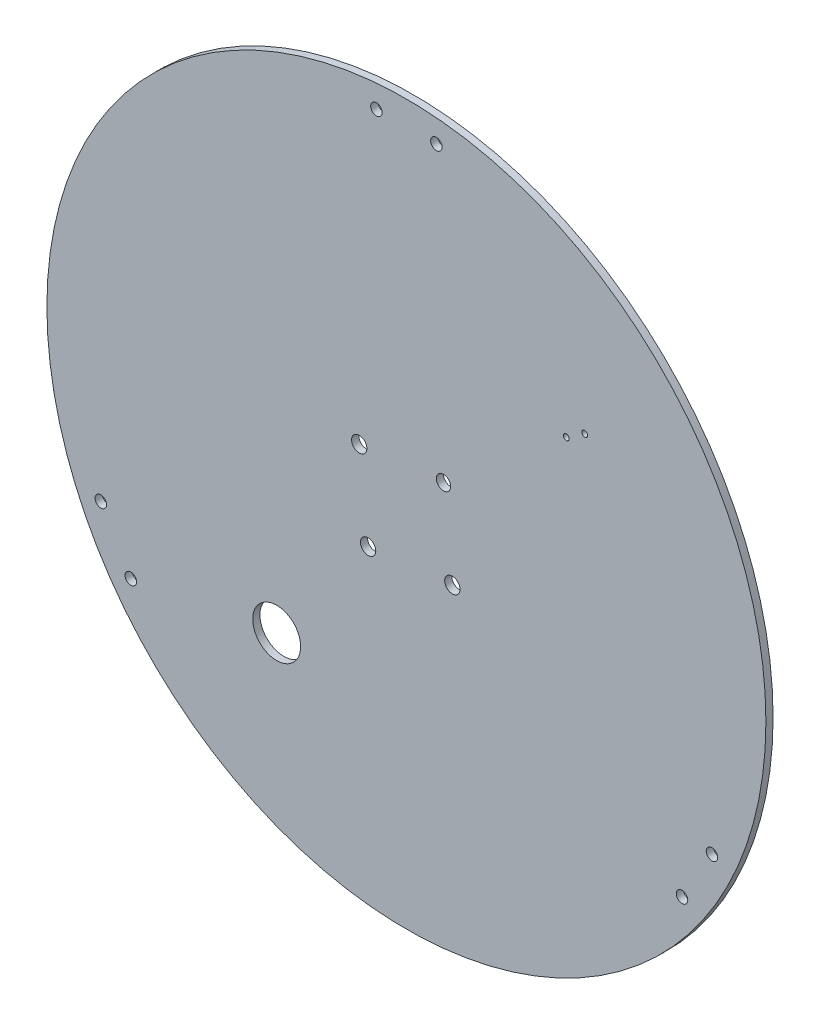
ISO-10303-21;
HEADER;
FILE_DESCRIPTION(('STEP AP214'),'2;1');
FILE_NAME('part.step','',(''),(''),'','','');
FILE_SCHEMA(('AUTOMOTIVE_DESIGN { 1 0 10303 214 1 1 1 1 }'));
ENDSEC;
DATA;
#1=APPLICATION_CONTEXT('core data for automotive mechanical design processes');
#2=APPLICATION_PROTOCOL_DEFINITION('international standard','automotive_design',2000,#1);
#3=PRODUCT_CONTEXT('',#1,'mechanical');
#4=PRODUCT('Part','Part','',(#3));
#5=PRODUCT_RELATED_PRODUCT_CATEGORY('part','',(#4));
#6=PRODUCT_DEFINITION_FORMATION('','',#4);
#7=PRODUCT_DEFINITION_CONTEXT('part definition',#1,'design');
#8=PRODUCT_DEFINITION('design','',#6,#7);
#9=PRODUCT_DEFINITION_SHAPE('','',#8);
#10=(LENGTH_UNIT() NAMED_UNIT(*) SI_UNIT(.MILLI.,.METRE.));
#11=(NAMED_UNIT(*) PLANE_ANGLE_UNIT() SI_UNIT($,.RADIAN.));
#12=(NAMED_UNIT(*) SI_UNIT($,.STERADIAN.) SOLID_ANGLE_UNIT());
#13=UNCERTAINTY_MEASURE_WITH_UNIT(LENGTH_MEASURE(1.E-05),#10,'distance_accuracy_value','');
#14=(GEOMETRIC_REPRESENTATION_CONTEXT(3) GLOBAL_UNCERTAINTY_ASSIGNED_CONTEXT((#13)) GLOBAL_UNIT_ASSIGNED_CONTEXT((#10,
#11,#12)) REPRESENTATION_CONTEXT('',''));
#15=CARTESIAN_POINT('',(0.,0.,0.));
#16=DIRECTION('',(0.,0.,1.));
#17=DIRECTION('',(1.,0.,0.));
#18=AXIS2_PLACEMENT_3D('',#15,#16,#17);
#19=CARTESIAN_POINT('',(1.00516695487656,1.28351001611725,3.));
#20=DIRECTION('',(0.,0.,1.));
#21=DIRECTION('',(1.,0.,0.));
#22=AXIS2_PLACEMENT_3D('',#19,#20,#21);
#23=PLANE('',#22);
#24=CARTESIAN_POINT('',(16.4868849924029,20.3912815485137,3.));
#25=DIRECTION('',(0.,0.,1.));
#26=DIRECTION('',(1.,0.,0.));
#27=AXIS2_PLACEMENT_3D('',#24,#25,#26);
#28=CIRCLE('',#27,2.98529571712637);
#29=CARTESIAN_POINT('',(19.4721807095292,20.3912815485137,3.));
#30=VERTEX_POINT('',#29);
#31=EDGE_CURVE('E115',#30,#30,#28,.T.);
#32=ORIENTED_EDGE('',*,*,#31,.F.);
#33=EDGE_LOOP('',(#32));
#34=FACE_BOUND('',#33,.T.);
#35=CARTESIAN_POINT('',(20.1825242525812,-14.7703772641566,3.));
#36=DIRECTION('',(0.,0.,1.));
#37=DIRECTION('',(1.,0.,0.));
#38=AXIS2_PLACEMENT_3D('',#35,#36,#37);
#39=CIRCLE('',#38,3.19999999999986);
#40=CARTESIAN_POINT('',(23.382524252581,-14.7703772641566,3.));
#41=VERTEX_POINT('',#40);
#42=EDGE_CURVE('E103',#41,#41,#39,.T.);
#43=ORIENTED_EDGE('',*,*,#42,.F.);
#44=EDGE_LOOP('',(#43));
#45=FACE_BOUND('',#44,.T.);
#46=CARTESIAN_POINT('',(67.7119996408379,62.3988380870922,3.));
#47=DIRECTION('',(0.,0.,1.));
#48=DIRECTION('',(1.,0.,0.));
#49=AXIS2_PLACEMENT_3D('',#46,#47,#48);
#50=CIRCLE('',#49,1.2);
#51=CARTESIAN_POINT('',(68.9119996408379,62.3988380870922,3.));
#52=VERTEX_POINT('',#51);
#53=EDGE_CURVE('E91',#52,#52,#50,.T.);
#54=ORIENTED_EDGE('',*,*,#53,.F.);
#55=EDGE_LOOP('',(#54));
#56=FACE_BOUND('',#55,.T.);
#57=CARTESIAN_POINT('',(-113.988389574945,-79.5418075311884,3.));
#58=DIRECTION('',(0.,0.,1.));
#59=DIRECTION('',(1.,0.,0.));
#60=AXIS2_PLACEMENT_3D('',#57,#58,#59);
#61=CIRCLE('',#60,2.4);
#62=CARTESIAN_POINT('',(-111.588389574945,-79.5418075311884,3.));
#63=VERTEX_POINT('',#62);
#64=EDGE_CURVE('E79',#63,#63,#61,.T.);
#65=ORIENTED_EDGE('',*,*,#64,.F.);
#66=EDGE_LOOP('',(#65));
#67=FACE_BOUND('',#66,.T.);
#68=CARTESIAN_POINT('',(128.498723484698,-57.8911724365774,3.));
#69=DIRECTION('',(0.,0.,1.));
#70=DIRECTION('',(1.,0.,0.));
#71=AXIS2_PLACEMENT_3D('',#68,#69,#70);
#72=CIRCLE('',#71,2.4);
#73=CARTESIAN_POINT('',(130.898723484698,-57.8911724365774,3.));
#74=VERTEX_POINT('',#73);
#75=EDGE_CURVE('E67',#74,#74,#72,.T.);
#76=ORIENTED_EDGE('',*,*,#75,.F.);
#77=EDGE_LOOP('',(#76));
#78=FACE_BOUND('',#77,.T.);
#79=CARTESIAN_POINT('',(-11.4948330451235,141.283510016117,3.));
#80=DIRECTION('',(0.,0.,1.));
#81=DIRECTION('',(1.,0.,0.));
#82=AXIS2_PLACEMENT_3D('',#79,#80,#81);
#83=CIRCLE('',#82,2.40000000000002);
#84=CARTESIAN_POINT('',(-9.09483304512353,141.283510016117,3.));
#85=VERTEX_POINT('',#84);
#86=EDGE_CURVE('E55',#85,#85,#83,.T.);
#87=ORIENTED_EDGE('',*,*,#86,.F.);
#88=EDGE_LOOP('',(#87));
#89=FACE_BOUND('',#88,.T.);
#90=CARTESIAN_POINT('',(1.00516695487656,1.28351001611725,3.));
#91=DIRECTION('',(0.,0.,1.));
#92=DIRECTION('',(1.,0.,0.));
#93=AXIS2_PLACEMENT_3D('',#90,#91,#92);
#94=CIRCLE('',#93,150.);
#95=CARTESIAN_POINT('',(151.005166954877,1.28351001611725,3.));
#96=VERTEX_POINT('',#95);
#97=EDGE_CURVE('E10',#96,#96,#94,.T.);
#98=ORIENTED_EDGE('',*,*,#97,.T.);
#99=EDGE_LOOP('',(#98));
#100=FACE_BOUND('',#99,.T.);
#101=CARTESIAN_POINT('',(13.5051669548765,141.283510016117,3.));
#102=DIRECTION('',(0.,0.,1.));
#103=DIRECTION('',(1.,0.,0.));
#104=AXIS2_PLACEMENT_3D('',#101,#102,#103);
#105=CIRCLE('',#104,2.40000000000001);
#106=CARTESIAN_POINT('',(15.9051669548765,141.283510016117,3.));
#107=VERTEX_POINT('',#106);
#108=EDGE_CURVE('E50',#107,#107,#105,.T.);
#109=ORIENTED_EDGE('',*,*,#108,.F.);
#110=EDGE_LOOP('',(#109));
#111=FACE_BOUND('',#110,.T.);
#112=CARTESIAN_POINT('',(115.998723484698,-79.5418075311884,3.));
#113=DIRECTION('',(0.,0.,1.));
#114=DIRECTION('',(1.,0.,0.));
#115=AXIS2_PLACEMENT_3D('',#112,#113,#114);
#116=CIRCLE('',#115,2.4);
#117=CARTESIAN_POINT('',(118.398723484698,-79.5418075311884,3.));
#118=VERTEX_POINT('',#117);
#119=EDGE_CURVE('E61',#118,#118,#116,.T.);
#120=ORIENTED_EDGE('',*,*,#119,.F.);
#121=EDGE_LOOP('',(#120));
#122=FACE_BOUND('',#121,.T.);
#123=CARTESIAN_POINT('',(-126.488389574945,-57.8911724365775,3.));
#124=DIRECTION('',(0.,0.,1.));
#125=DIRECTION('',(1.,0.,0.));
#126=AXIS2_PLACEMENT_3D('',#123,#124,#125);
#127=CIRCLE('',#126,2.4);
#128=CARTESIAN_POINT('',(-124.088389574945,-57.8911724365775,3.));
#129=VERTEX_POINT('',#128);
#130=EDGE_CURVE('E73',#129,#129,#127,.T.);
#131=ORIENTED_EDGE('',*,*,#130,.F.);
#132=EDGE_LOOP('',(#131));
#133=FACE_BOUND('',#132,.T.);
#134=CARTESIAN_POINT('',(75.4119996408379,67.4988380870922,3.));
#135=DIRECTION('',(0.,0.,1.));
#136=DIRECTION('',(1.,0.,0.));
#137=AXIS2_PLACEMENT_3D('',#134,#135,#136);
#138=CIRCLE('',#137,1.2);
#139=CARTESIAN_POINT('',(76.6119996408379,67.4988380870922,3.));
#140=VERTEX_POINT('',#139);
#141=EDGE_CURVE('E85',#140,#140,#138,.T.);
#142=ORIENTED_EDGE('',*,*,#141,.F.);
#143=EDGE_LOOP('',(#142));
#144=FACE_BOUND('',#143,.T.);
#145=CARTESIAN_POINT('',(-53.1206434953184,-68.716489983883,3.));
#146=DIRECTION('',(0.,0.,1.));
#147=DIRECTION('',(1.,0.,0.));
#148=AXIS2_PLACEMENT_3D('',#145,#146,#147);
#149=CIRCLE('',#148,10.);
#150=CARTESIAN_POINT('',(-43.1206434953184,-68.716489983883,3.));
#151=VERTEX_POINT('',#150);
#152=EDGE_CURVE('E97',#151,#151,#149,.T.);
#153=ORIENTED_EDGE('',*,*,#152,.F.);
#154=EDGE_LOOP('',(#153));
#155=FACE_BOUND('',#154,.T.);
#156=CARTESIAN_POINT('',(-14.9791345600891,-18.4660165243349,3.));
#157=DIRECTION('',(0.,0.,1.));
#158=DIRECTION('',(1.,0.,0.));
#159=AXIS2_PLACEMENT_3D('',#156,#157,#158);
#160=CIRCLE('',#159,3.19999999999987);
#161=CARTESIAN_POINT('',(-11.7791345600892,-18.4660165243349,3.));
#162=VERTEX_POINT('',#161);
#163=EDGE_CURVE('E109',#162,#162,#160,.T.);
#164=ORIENTED_EDGE('',*,*,#163,.F.);
#165=EDGE_LOOP('',(#164));
#166=FACE_BOUND('',#165,.T.);
#167=CARTESIAN_POINT('',(-18.6747738202674,16.6956422883354,3.));
#168=DIRECTION('',(0.,0.,1.));
#169=DIRECTION('',(1.,0.,0.));
#170=AXIS2_PLACEMENT_3D('',#167,#168,#169);
#171=CIRCLE('',#170,3.19999999999986);
#172=CARTESIAN_POINT('',(-15.4747738202676,16.6956422883354,3.));
#173=VERTEX_POINT('',#172);
#174=EDGE_CURVE('E121',#173,#173,#171,.T.);
#175=ORIENTED_EDGE('',*,*,#174,.F.);
#176=EDGE_LOOP('',(#175));
#177=FACE_BOUND('',#176,.T.);
#178=ADVANCED_FACE('F39',(#34,#45,#56,#67,#78,#89,#100,#111,#122,#133,#144,#155,#166,#177),#23,.T.);
#179=CARTESIAN_POINT('',(1.00516695487656,1.28351001611725,0.));
#180=DIRECTION('',(0.,0.,1.));
#181=DIRECTION('',(1.,0.,0.));
#182=AXIS2_PLACEMENT_3D('',#179,#180,#181);
#183=PLANE('',#182);
#184=CARTESIAN_POINT('',(1.00516695487656,1.28351001611725,0.));
#185=DIRECTION('',(0.,0.,1.));
#186=DIRECTION('',(1.,0.,0.));
#187=AXIS2_PLACEMENT_3D('',#184,#185,#186);
#188=CIRCLE('',#187,150.);
#189=CARTESIAN_POINT('',(151.005166954877,1.28351001611725,0.));
#190=VERTEX_POINT('',#189);
#191=EDGE_CURVE('E43',#190,#190,#188,.T.);
#192=ORIENTED_EDGE('',*,*,#191,.F.);
#193=EDGE_LOOP('',(#192));
#194=FACE_BOUND('',#193,.T.);
#195=CARTESIAN_POINT('',(13.5051669548765,141.283510016117,0.));
#196=DIRECTION('',(0.,0.,1.));
#197=DIRECTION('',(1.,0.,0.));
#198=AXIS2_PLACEMENT_3D('',#195,#196,#197);
#199=CIRCLE('',#198,2.40000000000001);
#200=CARTESIAN_POINT('',(15.9051669548765,141.283510016117,0.));
#201=VERTEX_POINT('',#200);
#202=EDGE_CURVE('E52',#201,#201,#199,.T.);
#203=ORIENTED_EDGE('',*,*,#202,.T.);
#204=EDGE_LOOP('',(#203));
#205=FACE_BOUND('',#204,.T.);
#206=CARTESIAN_POINT('',(-11.4948330451235,141.283510016117,0.));
#207=DIRECTION('',(0.,0.,1.));
#208=DIRECTION('',(1.,0.,0.));
#209=AXIS2_PLACEMENT_3D('',#206,#207,#208);
#210=CIRCLE('',#209,2.40000000000002);
#211=CARTESIAN_POINT('',(-9.09483304512353,141.283510016117,0.));
#212=VERTEX_POINT('',#211);
#213=EDGE_CURVE('E58',#212,#212,#210,.T.);
#214=ORIENTED_EDGE('',*,*,#213,.T.);
#215=EDGE_LOOP('',(#214));
#216=FACE_BOUND('',#215,.T.);
#217=CARTESIAN_POINT('',(115.998723484698,-79.5418075311884,0.));
#218=DIRECTION('',(0.,0.,1.));
#219=DIRECTION('',(1.,0.,0.));
#220=AXIS2_PLACEMENT_3D('',#217,#218,#219);
#221=CIRCLE('',#220,2.4);
#222=CARTESIAN_POINT('',(118.398723484698,-79.5418075311884,0.));
#223=VERTEX_POINT('',#222);
#224=EDGE_CURVE('E64',#223,#223,#221,.T.);
#225=ORIENTED_EDGE('',*,*,#224,.T.);
#226=EDGE_LOOP('',(#225));
#227=FACE_BOUND('',#226,.T.);
#228=CARTESIAN_POINT('',(128.498723484698,-57.8911724365774,0.));
#229=DIRECTION('',(0.,0.,1.));
#230=DIRECTION('',(1.,0.,0.));
#231=AXIS2_PLACEMENT_3D('',#228,#229,#230);
#232=CIRCLE('',#231,2.4);
#233=CARTESIAN_POINT('',(130.898723484698,-57.8911724365774,0.));
#234=VERTEX_POINT('',#233);
#235=EDGE_CURVE('E70',#234,#234,#232,.T.);
#236=ORIENTED_EDGE('',*,*,#235,.T.);
#237=EDGE_LOOP('',(#236));
#238=FACE_BOUND('',#237,.T.);
#239=CARTESIAN_POINT('',(-126.488389574945,-57.8911724365775,0.));
#240=DIRECTION('',(0.,0.,1.));
#241=DIRECTION('',(1.,0.,0.));
#242=AXIS2_PLACEMENT_3D('',#239,#240,#241);
#243=CIRCLE('',#242,2.4);
#244=CARTESIAN_POINT('',(-124.088389574945,-57.8911724365775,0.));
#245=VERTEX_POINT('',#244);
#246=EDGE_CURVE('E76',#245,#245,#243,.T.);
#247=ORIENTED_EDGE('',*,*,#246,.T.);
#248=EDGE_LOOP('',(#247));
#249=FACE_BOUND('',#248,.T.);
#250=CARTESIAN_POINT('',(-113.988389574945,-79.5418075311884,0.));
#251=DIRECTION('',(0.,0.,1.));
#252=DIRECTION('',(1.,0.,0.));
#253=AXIS2_PLACEMENT_3D('',#250,#251,#252);
#254=CIRCLE('',#253,2.4);
#255=CARTESIAN_POINT('',(-111.588389574945,-79.5418075311884,0.));
#256=VERTEX_POINT('',#255);
#257=EDGE_CURVE('E82',#256,#256,#254,.T.);
#258=ORIENTED_EDGE('',*,*,#257,.T.);
#259=EDGE_LOOP('',(#258));
#260=FACE_BOUND('',#259,.T.);
#261=CARTESIAN_POINT('',(75.4119996408379,67.4988380870922,0.));
#262=DIRECTION('',(0.,0.,1.));
#263=DIRECTION('',(1.,0.,0.));
#264=AXIS2_PLACEMENT_3D('',#261,#262,#263);
#265=CIRCLE('',#264,1.2);
#266=CARTESIAN_POINT('',(76.6119996408379,67.4988380870922,0.));
#267=VERTEX_POINT('',#266);
#268=EDGE_CURVE('E88',#267,#267,#265,.T.);
#269=ORIENTED_EDGE('',*,*,#268,.T.);
#270=EDGE_LOOP('',(#269));
#271=FACE_BOUND('',#270,.T.);
#272=CARTESIAN_POINT('',(67.7119996408379,62.3988380870922,0.));
#273=DIRECTION('',(0.,0.,1.));
#274=DIRECTION('',(1.,0.,0.));
#275=AXIS2_PLACEMENT_3D('',#272,#273,#274);
#276=CIRCLE('',#275,1.2);
#277=CARTESIAN_POINT('',(68.9119996408379,62.3988380870922,0.));
#278=VERTEX_POINT('',#277);
#279=EDGE_CURVE('E94',#278,#278,#276,.T.);
#280=ORIENTED_EDGE('',*,*,#279,.T.);
#281=EDGE_LOOP('',(#280));
#282=FACE_BOUND('',#281,.T.);
#283=CARTESIAN_POINT('',(-53.1206434953184,-68.716489983883,0.));
#284=DIRECTION('',(0.,0.,1.));
#285=DIRECTION('',(1.,0.,0.));
#286=AXIS2_PLACEMENT_3D('',#283,#284,#285);
#287=CIRCLE('',#286,10.);
#288=CARTESIAN_POINT('',(-43.1206434953184,-68.716489983883,0.));
#289=VERTEX_POINT('',#288);
#290=EDGE_CURVE('E100',#289,#289,#287,.T.);
#291=ORIENTED_EDGE('',*,*,#290,.T.);
#292=EDGE_LOOP('',(#291));
#293=FACE_BOUND('',#292,.T.);
#294=CARTESIAN_POINT('',(20.1825242525812,-14.7703772641566,0.));
#295=DIRECTION('',(0.,0.,1.));
#296=DIRECTION('',(1.,0.,0.));
#297=AXIS2_PLACEMENT_3D('',#294,#295,#296);
#298=CIRCLE('',#297,3.19999999999986);
#299=CARTESIAN_POINT('',(23.382524252581,-14.7703772641566,0.));
#300=VERTEX_POINT('',#299);
#301=EDGE_CURVE('E106',#300,#300,#298,.T.);
#302=ORIENTED_EDGE('',*,*,#301,.T.);
#303=EDGE_LOOP('',(#302));
#304=FACE_BOUND('',#303,.T.);
#305=CARTESIAN_POINT('',(-14.9791345600891,-18.4660165243349,0.));
#306=DIRECTION('',(0.,0.,1.));
#307=DIRECTION('',(1.,0.,0.));
#308=AXIS2_PLACEMENT_3D('',#305,#306,#307);
#309=CIRCLE('',#308,3.19999999999987);
#310=CARTESIAN_POINT('',(-11.7791345600892,-18.4660165243349,0.));
#311=VERTEX_POINT('',#310);
#312=EDGE_CURVE('E112',#311,#311,#309,.T.);
#313=ORIENTED_EDGE('',*,*,#312,.T.);
#314=EDGE_LOOP('',(#313));
#315=FACE_BOUND('',#314,.T.);
#316=CARTESIAN_POINT('',(16.4868849924029,20.3912815485137,0.));
#317=DIRECTION('',(0.,0.,1.));
#318=DIRECTION('',(1.,0.,0.));
#319=AXIS2_PLACEMENT_3D('',#316,#317,#318);
#320=CIRCLE('',#319,2.98529571712637);
#321=CARTESIAN_POINT('',(19.4721807095292,20.3912815485137,0.));
#322=VERTEX_POINT('',#321);
#323=EDGE_CURVE('E118',#322,#322,#320,.T.);
#324=ORIENTED_EDGE('',*,*,#323,.T.);
#325=EDGE_LOOP('',(#324));
#326=FACE_BOUND('',#325,.T.);
#327=CARTESIAN_POINT('',(-18.6747738202674,16.6956422883354,0.));
#328=DIRECTION('',(0.,0.,1.));
#329=DIRECTION('',(1.,0.,0.));
#330=AXIS2_PLACEMENT_3D('',#327,#328,#329);
#331=CIRCLE('',#330,3.19999999999986);
#332=CARTESIAN_POINT('',(-15.4747738202676,16.6956422883354,0.));
#333=VERTEX_POINT('',#332);
#334=EDGE_CURVE('E124',#333,#333,#331,.T.);
#335=ORIENTED_EDGE('',*,*,#334,.T.);
#336=EDGE_LOOP('',(#335));
#337=FACE_BOUND('',#336,.T.);
#338=ADVANCED_FACE('F134',(#194,#205,#216,#227,#238,#249,#260,#271,#282,#293,#304,#315,#326,
#337),#183,.F.);
#339=CARTESIAN_POINT('',(1.00516695487656,1.28351001611725,3.));
#340=DIRECTION('',(0.,0.,-1.));
#341=DIRECTION('',(-1.,0.,0.));
#342=AXIS2_PLACEMENT_3D('',#339,#340,#341);
#343=CYLINDRICAL_SURFACE('',#342,150.);
#344=ORIENTED_EDGE('',*,*,#97,.F.);
#345=EDGE_LOOP('',(#344));
#346=FACE_BOUND('',#345,.T.);
#347=ORIENTED_EDGE('',*,*,#191,.T.);
#348=EDGE_LOOP('',(#347));
#349=FACE_BOUND('',#348,.T.);
#350=ADVANCED_FACE('F41',(#346,#349),#343,.T.);
#351=CARTESIAN_POINT('',(13.5051669548765,141.283510016117,3.));
#352=DIRECTION('',(0.,0.,-1.));
#353=DIRECTION('',(-1.,0.,0.));
#354=AXIS2_PLACEMENT_3D('',#351,#352,#353);
#355=CYLINDRICAL_SURFACE('',#354,2.40000000000001);
#356=ORIENTED_EDGE('',*,*,#108,.T.);
#357=EDGE_LOOP('',(#356));
#358=FACE_BOUND('',#357,.T.);
#359=ORIENTED_EDGE('',*,*,#202,.F.);
#360=EDGE_LOOP('',(#359));
#361=FACE_BOUND('',#360,.T.);
#362=ADVANCED_FACE('F144',(#358,#361),#355,.F.);
#363=CARTESIAN_POINT('',(-11.4948330451235,141.283510016117,3.));
#364=DIRECTION('',(0.,0.,-1.));
#365=DIRECTION('',(-1.,0.,0.));
#366=AXIS2_PLACEMENT_3D('',#363,#364,#365);
#367=CYLINDRICAL_SURFACE('',#366,2.40000000000002);
#368=ORIENTED_EDGE('',*,*,#86,.T.);
#369=EDGE_LOOP('',(#368));
#370=FACE_BOUND('',#369,.T.);
#371=ORIENTED_EDGE('',*,*,#213,.F.);
#372=EDGE_LOOP('',(#371));
#373=FACE_BOUND('',#372,.T.);
#374=ADVANCED_FACE('F147',(#370,#373),#367,.F.);
#375=CARTESIAN_POINT('',(115.998723484698,-79.5418075311884,3.));
#376=DIRECTION('',(0.,0.,-1.));
#377=DIRECTION('',(-1.,0.,0.));
#378=AXIS2_PLACEMENT_3D('',#375,#376,#377);
#379=CYLINDRICAL_SURFACE('',#378,2.4);
#380=ORIENTED_EDGE('',*,*,#119,.T.);
#381=EDGE_LOOP('',(#380));
#382=FACE_BOUND('',#381,.T.);
#383=ORIENTED_EDGE('',*,*,#224,.F.);
#384=EDGE_LOOP('',(#383));
#385=FACE_BOUND('',#384,.T.);
#386=ADVANCED_FACE('F151',(#382,#385),#379,.F.);
#387=CARTESIAN_POINT('',(128.498723484698,-57.8911724365774,3.));
#388=DIRECTION('',(0.,0.,-1.));
#389=DIRECTION('',(-1.,0.,0.));
#390=AXIS2_PLACEMENT_3D('',#387,#388,#389);
#391=CYLINDRICAL_SURFACE('',#390,2.4);
#392=ORIENTED_EDGE('',*,*,#75,.T.);
#393=EDGE_LOOP('',(#392));
#394=FACE_BOUND('',#393,.T.);
#395=ORIENTED_EDGE('',*,*,#235,.F.);
#396=EDGE_LOOP('',(#395));
#397=FACE_BOUND('',#396,.T.);
#398=ADVANCED_FACE('F155',(#394,#397),#391,.F.);
#399=CARTESIAN_POINT('',(-126.488389574945,-57.8911724365775,3.));
#400=DIRECTION('',(0.,0.,-1.));
#401=DIRECTION('',(-1.,0.,0.));
#402=AXIS2_PLACEMENT_3D('',#399,#400,#401);
#403=CYLINDRICAL_SURFACE('',#402,2.4);
#404=ORIENTED_EDGE('',*,*,#130,.T.);
#405=EDGE_LOOP('',(#404));
#406=FACE_BOUND('',#405,.T.);
#407=ORIENTED_EDGE('',*,*,#246,.F.);
#408=EDGE_LOOP('',(#407));
#409=FACE_BOUND('',#408,.T.);
#410=ADVANCED_FACE('F159',(#406,#409),#403,.F.);
#411=CARTESIAN_POINT('',(-113.988389574945,-79.5418075311884,3.));
#412=DIRECTION('',(0.,0.,-1.));
#413=DIRECTION('',(-1.,0.,0.));
#414=AXIS2_PLACEMENT_3D('',#411,#412,#413);
#415=CYLINDRICAL_SURFACE('',#414,2.4);
#416=ORIENTED_EDGE('',*,*,#64,.T.);
#417=EDGE_LOOP('',(#416));
#418=FACE_BOUND('',#417,.T.);
#419=ORIENTED_EDGE('',*,*,#257,.F.);
#420=EDGE_LOOP('',(#419));
#421=FACE_BOUND('',#420,.T.);
#422=ADVANCED_FACE('F163',(#418,#421),#415,.F.);
#423=CARTESIAN_POINT('',(75.4119996408379,67.4988380870922,3.));
#424=DIRECTION('',(0.,0.,-1.));
#425=DIRECTION('',(-1.,0.,0.));
#426=AXIS2_PLACEMENT_3D('',#423,#424,#425);
#427=CYLINDRICAL_SURFACE('',#426,1.2);
#428=ORIENTED_EDGE('',*,*,#141,.T.);
#429=EDGE_LOOP('',(#428));
#430=FACE_BOUND('',#429,.T.);
#431=ORIENTED_EDGE('',*,*,#268,.F.);
#432=EDGE_LOOP('',(#431));
#433=FACE_BOUND('',#432,.T.);
#434=ADVANCED_FACE('F167',(#430,#433),#427,.F.);
#435=CARTESIAN_POINT('',(67.7119996408379,62.3988380870922,3.));
#436=DIRECTION('',(0.,0.,-1.));
#437=DIRECTION('',(-1.,0.,0.));
#438=AXIS2_PLACEMENT_3D('',#435,#436,#437);
#439=CYLINDRICAL_SURFACE('',#438,1.2);
#440=ORIENTED_EDGE('',*,*,#53,.T.);
#441=EDGE_LOOP('',(#440));
#442=FACE_BOUND('',#441,.T.);
#443=ORIENTED_EDGE('',*,*,#279,.F.);
#444=EDGE_LOOP('',(#443));
#445=FACE_BOUND('',#444,.T.);
#446=ADVANCED_FACE('F171',(#442,#445),#439,.F.);
#447=CARTESIAN_POINT('',(-53.1206434953184,-68.716489983883,3.));
#448=DIRECTION('',(0.,0.,-1.));
#449=DIRECTION('',(-1.,0.,0.));
#450=AXIS2_PLACEMENT_3D('',#447,#448,#449);
#451=CYLINDRICAL_SURFACE('',#450,10.);
#452=ORIENTED_EDGE('',*,*,#152,.T.);
#453=EDGE_LOOP('',(#452));
#454=FACE_BOUND('',#453,.T.);
#455=ORIENTED_EDGE('',*,*,#290,.F.);
#456=EDGE_LOOP('',(#455));
#457=FACE_BOUND('',#456,.T.);
#458=ADVANCED_FACE('F175',(#454,#457),#451,.F.);
#459=CARTESIAN_POINT('',(20.1825242525812,-14.7703772641566,3.));
#460=DIRECTION('',(0.,0.,-1.));
#461=DIRECTION('',(-1.,0.,0.));
#462=AXIS2_PLACEMENT_3D('',#459,#460,#461);
#463=CYLINDRICAL_SURFACE('',#462,3.19999999999986);
#464=ORIENTED_EDGE('',*,*,#42,.T.);
#465=EDGE_LOOP('',(#464));
#466=FACE_BOUND('',#465,.T.);
#467=ORIENTED_EDGE('',*,*,#301,.F.);
#468=EDGE_LOOP('',(#467));
#469=FACE_BOUND('',#468,.T.);
#470=ADVANCED_FACE('F179',(#466,#469),#463,.F.);
#471=CARTESIAN_POINT('',(-14.9791345600891,-18.4660165243349,3.));
#472=DIRECTION('',(0.,0.,-1.));
#473=DIRECTION('',(-1.,0.,0.));
#474=AXIS2_PLACEMENT_3D('',#471,#472,#473);
#475=CYLINDRICAL_SURFACE('',#474,3.19999999999987);
#476=ORIENTED_EDGE('',*,*,#163,.T.);
#477=EDGE_LOOP('',(#476));
#478=FACE_BOUND('',#477,.T.);
#479=ORIENTED_EDGE('',*,*,#312,.F.);
#480=EDGE_LOOP('',(#479));
#481=FACE_BOUND('',#480,.T.);
#482=ADVANCED_FACE('F183',(#478,#481),#475,.F.);
#483=CARTESIAN_POINT('',(16.4868849924029,20.3912815485137,3.));
#484=DIRECTION('',(0.,0.,-1.));
#485=DIRECTION('',(-1.,0.,0.));
#486=AXIS2_PLACEMENT_3D('',#483,#484,#485);
#487=CYLINDRICAL_SURFACE('',#486,2.98529571712637);
#488=ORIENTED_EDGE('',*,*,#31,.T.);
#489=EDGE_LOOP('',(#488));
#490=FACE_BOUND('',#489,.T.);
#491=ORIENTED_EDGE('',*,*,#323,.F.);
#492=EDGE_LOOP('',(#491));
#493=FACE_BOUND('',#492,.T.);
#494=ADVANCED_FACE('F187',(#490,#493),#487,.F.);
#495=CARTESIAN_POINT('',(-18.6747738202674,16.6956422883354,3.));
#496=DIRECTION('',(0.,0.,-1.));
#497=DIRECTION('',(-1.,0.,0.));
#498=AXIS2_PLACEMENT_3D('',#495,#496,#497);
#499=CYLINDRICAL_SURFACE('',#498,3.19999999999986);
#500=ORIENTED_EDGE('',*,*,#174,.T.);
#501=EDGE_LOOP('',(#500));
#502=FACE_BOUND('',#501,.T.);
#503=ORIENTED_EDGE('',*,*,#334,.F.);
#504=EDGE_LOOP('',(#503));
#505=FACE_BOUND('',#504,.T.);
#506=ADVANCED_FACE('F130',(#502,#505),#499,.F.);
#507=CLOSED_SHELL('',(#178,#338,#350,#362,#374,#386,#398,#410,#422,#434,#446,#458,#470,#482,
#494,#506));
#508=MANIFOLD_SOLID_BREP('B2',#507);
#509=ADVANCED_BREP_SHAPE_REPRESENTATION('',(#18,#508),#14);
#510=SHAPE_DEFINITION_REPRESENTATION(#9,#509);
ENDSEC;
END-ISO-10303-21;
